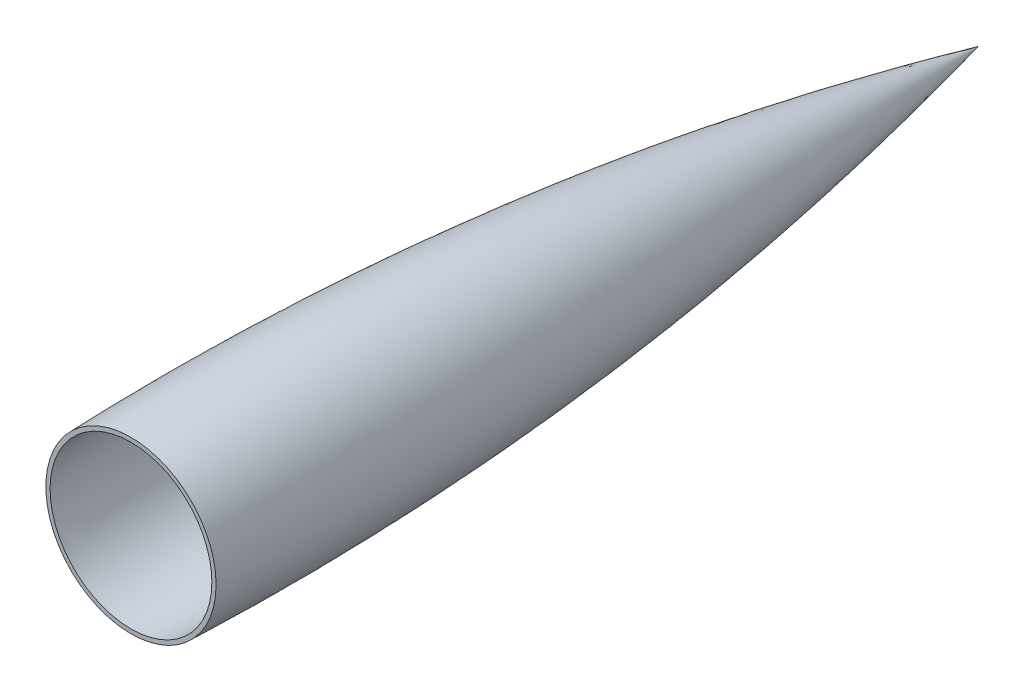
ISO-10303-21;
HEADER;
FILE_DESCRIPTION(('STEP AP214'),'2;1');
FILE_NAME('part.step','',(''),(''),'','','');
FILE_SCHEMA(('AUTOMOTIVE_DESIGN { 1 0 10303 214 1 1 1 1 }'));
ENDSEC;
DATA;
#1=APPLICATION_CONTEXT('core data for automotive mechanical design processes');
#2=APPLICATION_PROTOCOL_DEFINITION('international standard','automotive_design',2000,#1);
#3=PRODUCT_CONTEXT('',#1,'mechanical');
#4=PRODUCT('Part','Part','',(#3));
#5=PRODUCT_RELATED_PRODUCT_CATEGORY('part','',(#4));
#6=PRODUCT_DEFINITION_FORMATION('','',#4);
#7=PRODUCT_DEFINITION_CONTEXT('part definition',#1,'design');
#8=PRODUCT_DEFINITION('design','',#6,#7);
#9=PRODUCT_DEFINITION_SHAPE('','',#8);
#10=(LENGTH_UNIT() NAMED_UNIT(*) SI_UNIT(.MILLI.,.METRE.));
#11=(NAMED_UNIT(*) PLANE_ANGLE_UNIT() SI_UNIT($,.RADIAN.));
#12=(NAMED_UNIT(*) SI_UNIT($,.STERADIAN.) SOLID_ANGLE_UNIT());
#13=UNCERTAINTY_MEASURE_WITH_UNIT(LENGTH_MEASURE(1.E-05),#10,'distance_accuracy_value','');
#14=(GEOMETRIC_REPRESENTATION_CONTEXT(3) GLOBAL_UNCERTAINTY_ASSIGNED_CONTEXT((#13)) GLOBAL_UNIT_ASSIGNED_CONTEXT((#10,
#11,#12)) REPRESENTATION_CONTEXT('',''));
#15=CARTESIAN_POINT('',(0.,0.,0.));
#16=DIRECTION('',(0.,0.,1.));
#17=DIRECTION('',(1.,0.,0.));
#18=AXIS2_PLACEMENT_3D('',#15,#16,#17);
#19=CARTESIAN_POINT('',(-1873.51753569451,0.,-58.0150971627022));
#20=DIRECTION('',(0.,-1.,0.));
#21=DIRECTION('',(1.,0.,0.));
#22=AXIS2_PLACEMENT_3D('',#19,#20,#21);
#23=CIRCLE('',#22,1976.47717132959);
#24=TRIMMED_CURVE('',#23,(PARAMETER_VALUE(-0.229684350297123)),
(PARAMETER_VALUE(0.229684350297123)),.T.,.PARAMETER.);
#25=CARTESIAN_POINT('',(51.0539999999999,0.,-58.0150971627022));
#26=DIRECTION('',(0.,0.,1.));
#27=AXIS1_PLACEMENT('',#25,#26);
#28=SURFACE_OF_REVOLUTION('',#24,#27);
#29=CARTESIAN_POINT('',(51.0539999999999,0.,0.));
#30=DIRECTION('',(0.,0.,1.));
#31=DIRECTION('',(1.,0.,0.));
#32=AXIS2_PLACEMENT_3D('',#29,#30,#31);
#33=CIRCLE('',#32,51.0539999999999);
#34=CARTESIAN_POINT('',(102.108,0.,0.));
#35=VERTEX_POINT('',#34);
#36=EDGE_CURVE('E11',#35,#35,#33,.T.);
#37=ORIENTED_EDGE('',*,*,#36,.F.);
#38=EDGE_LOOP('',(#37));
#39=FACE_BOUND('',#38,.T.);
#40=CARTESIAN_POINT('',(51.0539999999999,0.,-508.));
#41=VERTEX_POINT('',#40);
#42=VERTEX_LOOP('',#41);
#43=FACE_BOUND('',#42,.T.);
#44=ADVANCED_FACE('F34',(#39,#43),#28,.T.);
#45=CARTESIAN_POINT('',(0.,0.,0.));
#46=DIRECTION('',(0.,0.,-1.));
#47=DIRECTION('',(-1.,0.,0.));
#48=AXIS2_PLACEMENT_3D('',#45,#46,#47);
#49=PLANE('',#48);
#50=CARTESIAN_POINT('',(51.0539999999999,0.,0.));
#51=DIRECTION('',(0.,0.,-1.));
#52=DIRECTION('',(-1.,0.,0.));
#53=AXIS2_PLACEMENT_3D('',#50,#51,#52);
#54=CIRCLE('',#53,48.5129036688603);
#55=CARTESIAN_POINT('',(2.54109633113964,0.,0.));
#56=VERTEX_POINT('',#55);
#57=EDGE_CURVE('E41',#56,#56,#54,.F.);
#58=ORIENTED_EDGE('',*,*,#57,.F.);
#59=EDGE_LOOP('',(#58));
#60=FACE_BOUND('',#59,.T.);
#61=ORIENTED_EDGE('',*,*,#36,.T.);
#62=EDGE_LOOP('',(#61));
#63=FACE_BOUND('',#62,.T.);
#64=ADVANCED_FACE('F49',(#60,#63),#49,.F.);
#65=CARTESIAN_POINT('',(-1873.51753569451,0.,-58.0150971627022));
#66=DIRECTION('',(0.,-1.,0.));
#67=DIRECTION('',(1.,0.,0.));
#68=AXIS2_PLACEMENT_3D('',#65,#66,#67);
#69=CIRCLE('',#68,1973.93717132959);
#70=TRIMMED_CURVE('',#69,(PARAMETER_VALUE(-0.224114510445878)),
(PARAMETER_VALUE(0.224114510445878)),.T.,.PARAMETER.);
#71=CARTESIAN_POINT('',(51.0539999999999,0.,-58.0150971627022));
#72=DIRECTION('',(0.,0.,1.));
#73=AXIS1_PLACEMENT('',#71,#72);
#74=SURFACE_OF_REVOLUTION('',#70,#73);
#75=ORIENTED_EDGE('',*,*,#57,.T.);
#76=EDGE_LOOP('',(#75));
#77=FACE_BOUND('',#76,.T.);
#78=CARTESIAN_POINT('',(51.0539999999999,0.,-496.709022754496));
#79=VERTEX_POINT('',#78);
#80=VERTEX_LOOP('',#79);
#81=FACE_BOUND('',#80,.T.);
#82=ADVANCED_FACE('F47',(#77,#81),#74,.F.);
#83=CLOSED_SHELL('',(#44,#64,#82));
#84=MANIFOLD_SOLID_BREP('B2',#83);
#85=ADVANCED_BREP_SHAPE_REPRESENTATION('',(#18,#84),#14);
#86=SHAPE_DEFINITION_REPRESENTATION(#9,#85);
ENDSEC;
END-ISO-10303-21;
